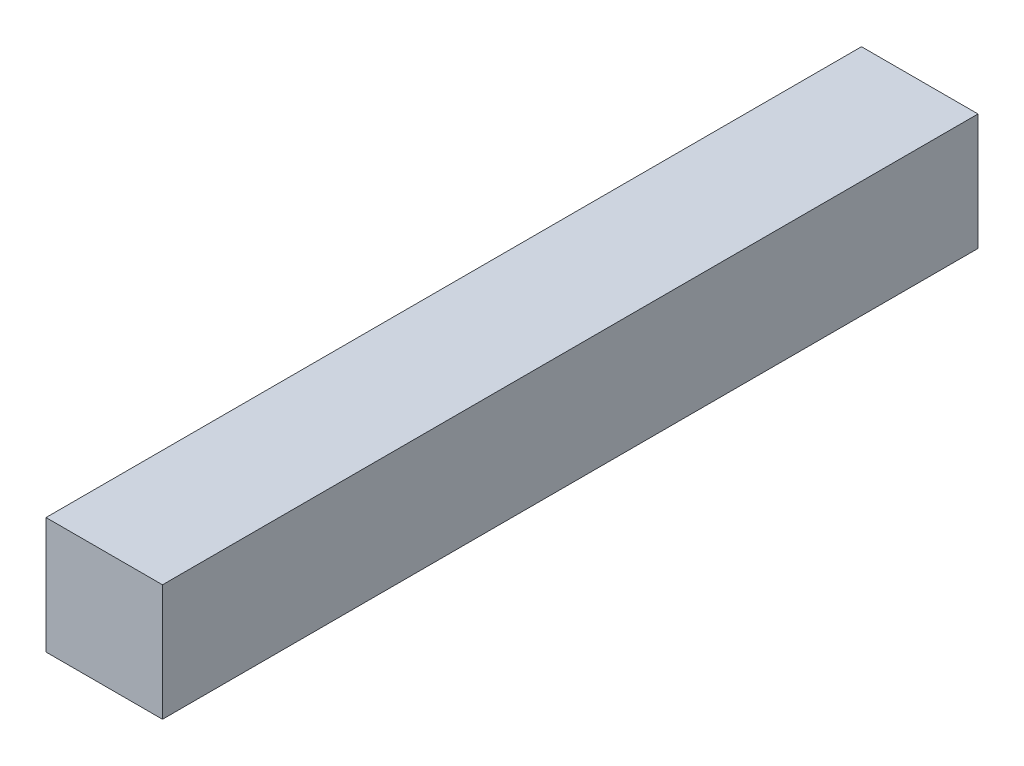
ISO-10303-21;
HEADER;
FILE_DESCRIPTION(('STEP AP214'),'2;1');
FILE_NAME('part.step','',(''),(''),'','','');
FILE_SCHEMA(('AUTOMOTIVE_DESIGN { 1 0 10303 214 1 1 1 1 }'));
ENDSEC;
DATA;
#1=APPLICATION_CONTEXT('core data for automotive mechanical design processes');
#2=APPLICATION_PROTOCOL_DEFINITION('international standard','automotive_design',2000,#1);
#3=PRODUCT_CONTEXT('',#1,'mechanical');
#4=PRODUCT('Part','Part','',(#3));
#5=PRODUCT_RELATED_PRODUCT_CATEGORY('part','',(#4));
#6=PRODUCT_DEFINITION_FORMATION('','',#4);
#7=PRODUCT_DEFINITION_CONTEXT('part definition',#1,'design');
#8=PRODUCT_DEFINITION('design','',#6,#7);
#9=PRODUCT_DEFINITION_SHAPE('','',#8);
#10=(LENGTH_UNIT() NAMED_UNIT(*) SI_UNIT(.MILLI.,.METRE.));
#11=(NAMED_UNIT(*) PLANE_ANGLE_UNIT() SI_UNIT($,.RADIAN.));
#12=(NAMED_UNIT(*) SI_UNIT($,.STERADIAN.) SOLID_ANGLE_UNIT());
#13=UNCERTAINTY_MEASURE_WITH_UNIT(LENGTH_MEASURE(1.E-05),#10,'distance_accuracy_value','');
#14=(GEOMETRIC_REPRESENTATION_CONTEXT(3) GLOBAL_UNCERTAINTY_ASSIGNED_CONTEXT((#13)) GLOBAL_UNIT_ASSIGNED_CONTEXT((#10,
#11,#12)) REPRESENTATION_CONTEXT('',''));
#15=CARTESIAN_POINT('',(0.,0.,0.));
#16=DIRECTION('',(0.,0.,1.));
#17=DIRECTION('',(1.,0.,0.));
#18=AXIS2_PLACEMENT_3D('',#15,#16,#17);
#19=CARTESIAN_POINT('',(0.,0.,177.8));
#20=DIRECTION('',(1.,0.,0.));
#21=DIRECTION('',(0.,0.,-1.));
#22=AXIS2_PLACEMENT_3D('',#19,#20,#21);
#23=PLANE('',#22);
#24=DIRECTION('',(0.,-1.,0.));
#25=VECTOR('',#24,1.);
#26=CARTESIAN_POINT('',(0.,0.,0.));
#27=LINE('',#26,#25);
#28=CARTESIAN_POINT('',(0.,25.4,0.));
#29=VERTEX_POINT('',#28);
#30=CARTESIAN_POINT('',(0.,0.,0.));
#31=VERTEX_POINT('',#30);
#32=EDGE_CURVE('E96',#29,#31,#27,.T.);
#33=ORIENTED_EDGE('',*,*,#32,.T.);
#34=DIRECTION('',(0.,0.,-1.));
#35=VECTOR('',#34,1.);
#36=CARTESIAN_POINT('',(0.,0.,177.8));
#37=LINE('',#36,#35);
#38=CARTESIAN_POINT('',(0.,0.,177.8));
#39=VERTEX_POINT('',#38);
#40=EDGE_CURVE('E11',#39,#31,#37,.T.);
#41=ORIENTED_EDGE('',*,*,#40,.F.);
#42=DIRECTION('',(0.,-1.,0.));
#43=VECTOR('',#42,1.);
#44=CARTESIAN_POINT('',(0.,0.,177.8));
#45=LINE('',#44,#43);
#46=CARTESIAN_POINT('',(0.,25.4,177.8));
#47=VERTEX_POINT('',#46);
#48=EDGE_CURVE('E84',#47,#39,#45,.T.);
#49=ORIENTED_EDGE('',*,*,#48,.F.);
#50=DIRECTION('',(0.,0.,-1.));
#51=VECTOR('',#50,1.);
#52=CARTESIAN_POINT('',(0.,25.4,177.8));
#53=LINE('',#52,#51);
#54=EDGE_CURVE('E92',#47,#29,#53,.T.);
#55=ORIENTED_EDGE('',*,*,#54,.T.);
#56=EDGE_LOOP('',(#33,#41,#49,#55));
#57=FACE_BOUND('',#56,.T.);
#58=ADVANCED_FACE('F33',(#57),#23,.F.);
#59=CARTESIAN_POINT('',(0.,0.,177.8));
#60=DIRECTION('',(0.,1.,0.));
#61=DIRECTION('',(0.,0.,1.));
#62=AXIS2_PLACEMENT_3D('',#59,#60,#61);
#63=PLANE('',#62);
#64=DIRECTION('',(1.,0.,0.));
#65=VECTOR('',#64,1.);
#66=CARTESIAN_POINT('',(0.,0.,0.));
#67=LINE('',#66,#65);
#68=CARTESIAN_POINT('',(25.4,0.,0.));
#69=VERTEX_POINT('',#68);
#70=EDGE_CURVE('E88',#31,#69,#67,.T.);
#71=ORIENTED_EDGE('',*,*,#70,.T.);
#72=DIRECTION('',(0.,0.,-1.));
#73=VECTOR('',#72,1.);
#74=CARTESIAN_POINT('',(25.4,0.,177.8));
#75=LINE('',#74,#73);
#76=CARTESIAN_POINT('',(25.4,0.,177.8));
#77=VERTEX_POINT('',#76);
#78=EDGE_CURVE('E41',#77,#69,#75,.T.);
#79=ORIENTED_EDGE('',*,*,#78,.F.);
#80=DIRECTION('',(1.,0.,0.));
#81=VECTOR('',#80,1.);
#82=CARTESIAN_POINT('',(0.,0.,177.8));
#83=LINE('',#82,#81);
#84=EDGE_CURVE('E79',#39,#77,#83,.T.);
#85=ORIENTED_EDGE('',*,*,#84,.F.);
#86=ORIENTED_EDGE('',*,*,#40,.T.);
#87=EDGE_LOOP('',(#71,#79,#85,#86));
#88=FACE_BOUND('',#87,.T.);
#89=ADVANCED_FACE('F87',(#88),#63,.F.);
#90=CARTESIAN_POINT('',(25.4,0.,177.8));
#91=DIRECTION('',(-1.,0.,0.));
#92=DIRECTION('',(0.,0.,1.));
#93=AXIS2_PLACEMENT_3D('',#90,#91,#92);
#94=PLANE('',#93);
#95=DIRECTION('',(0.,1.,0.));
#96=VECTOR('',#95,1.);
#97=CARTESIAN_POINT('',(25.4,0.,0.));
#98=LINE('',#97,#96);
#99=CARTESIAN_POINT('',(25.4,25.4,0.));
#100=VERTEX_POINT('',#99);
#101=EDGE_CURVE('E66',#69,#100,#98,.T.);
#102=ORIENTED_EDGE('',*,*,#101,.T.);
#103=DIRECTION('',(0.,0.,-1.));
#104=VECTOR('',#103,1.);
#105=CARTESIAN_POINT('',(25.4,25.4,177.8));
#106=LINE('',#105,#104);
#107=CARTESIAN_POINT('',(25.4,25.4,177.8));
#108=VERTEX_POINT('',#107);
#109=EDGE_CURVE('E89',#108,#100,#106,.T.);
#110=ORIENTED_EDGE('',*,*,#109,.F.);
#111=DIRECTION('',(0.,1.,0.));
#112=VECTOR('',#111,1.);
#113=CARTESIAN_POINT('',(25.4,0.,177.8));
#114=LINE('',#113,#112);
#115=EDGE_CURVE('E82',#77,#108,#114,.T.);
#116=ORIENTED_EDGE('',*,*,#115,.F.);
#117=ORIENTED_EDGE('',*,*,#78,.T.);
#118=EDGE_LOOP('',(#102,#110,#116,#117));
#119=FACE_BOUND('',#118,.T.);
#120=ADVANCED_FACE('F90',(#119),#94,.F.);
#121=CARTESIAN_POINT('',(0.,25.4,177.8));
#122=DIRECTION('',(0.,-1.,0.));
#123=DIRECTION('',(0.,0.,-1.));
#124=AXIS2_PLACEMENT_3D('',#121,#122,#123);
#125=PLANE('',#124);
#126=DIRECTION('',(-1.,0.,0.));
#127=VECTOR('',#126,1.);
#128=CARTESIAN_POINT('',(0.,25.4,0.));
#129=LINE('',#128,#127);
#130=EDGE_CURVE('E72',#100,#29,#129,.T.);
#131=ORIENTED_EDGE('',*,*,#130,.T.);
#132=ORIENTED_EDGE('',*,*,#54,.F.);
#133=DIRECTION('',(-1.,0.,0.));
#134=VECTOR('',#133,1.);
#135=CARTESIAN_POINT('',(0.,25.4,177.8));
#136=LINE('',#135,#134);
#137=EDGE_CURVE('E49',#108,#47,#136,.T.);
#138=ORIENTED_EDGE('',*,*,#137,.F.);
#139=ORIENTED_EDGE('',*,*,#109,.T.);
#140=EDGE_LOOP('',(#131,#132,#138,#139));
#141=FACE_BOUND('',#140,.T.);
#142=ADVANCED_FACE('F103',(#141),#125,.F.);
#143=CARTESIAN_POINT('',(0.,0.,177.8));
#144=DIRECTION('',(0.,0.,-1.));
#145=DIRECTION('',(-1.,0.,0.));
#146=AXIS2_PLACEMENT_3D('',#143,#144,#145);
#147=PLANE('',#146);
#148=ORIENTED_EDGE('',*,*,#48,.T.);
#149=ORIENTED_EDGE('',*,*,#84,.T.);
#150=ORIENTED_EDGE('',*,*,#115,.T.);
#151=ORIENTED_EDGE('',*,*,#137,.T.);
#152=EDGE_LOOP('',(#148,#149,#150,#151));
#153=FACE_BOUND('',#152,.T.);
#154=ADVANCED_FACE('F80',(#153),#147,.F.);
#155=CARTESIAN_POINT('',(0.,0.,0.));
#156=DIRECTION('',(0.,0.,-1.));
#157=DIRECTION('',(-1.,0.,0.));
#158=AXIS2_PLACEMENT_3D('',#155,#156,#157);
#159=PLANE('',#158);
#160=ORIENTED_EDGE('',*,*,#32,.F.);
#161=ORIENTED_EDGE('',*,*,#130,.F.);
#162=ORIENTED_EDGE('',*,*,#101,.F.);
#163=ORIENTED_EDGE('',*,*,#70,.F.);
#164=EDGE_LOOP('',(#160,#161,#162,#163));
#165=FACE_BOUND('',#164,.T.);
#166=ADVANCED_FACE('F106',(#165),#159,.T.);
#167=CLOSED_SHELL('',(#58,#89,#120,#142,#154,#166));
#168=MANIFOLD_SOLID_BREP('B2',#167);
#169=ADVANCED_BREP_SHAPE_REPRESENTATION('',(#18,#168),#14);
#170=SHAPE_DEFINITION_REPRESENTATION(#9,#169);
ENDSEC;
END-ISO-10303-21;
